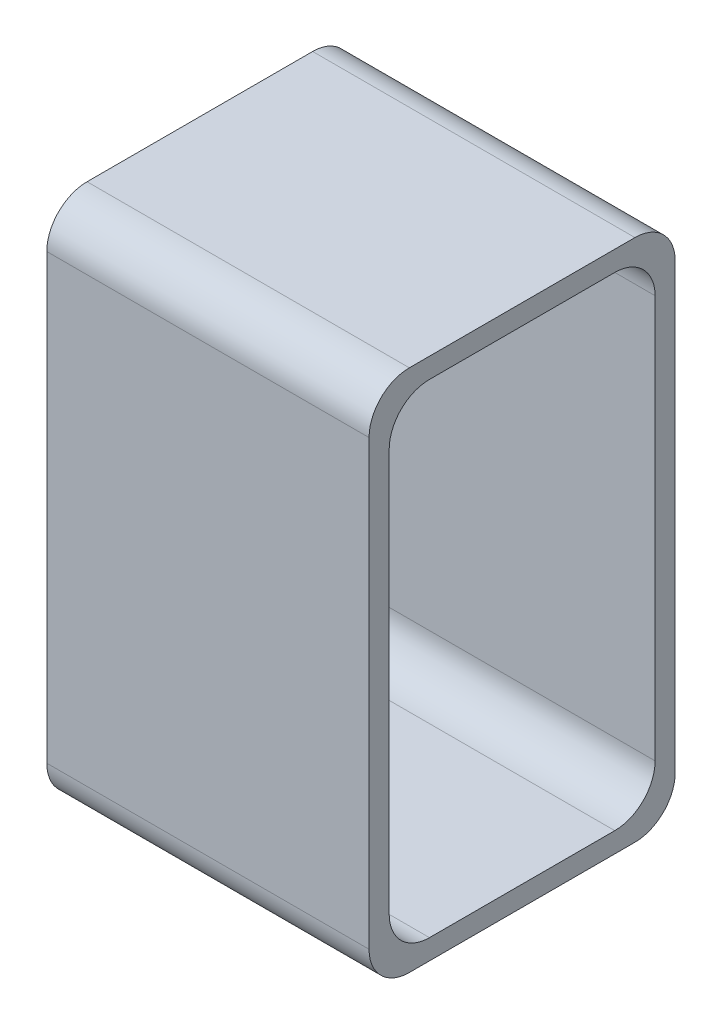
ISO-10303-21;
HEADER;
FILE_DESCRIPTION(('STEP AP214'),'2;1');
FILE_NAME('part.step','',(''),(''),'','','');
FILE_SCHEMA(('AUTOMOTIVE_DESIGN { 1 0 10303 214 1 1 1 1 }'));
ENDSEC;
DATA;
#1=APPLICATION_CONTEXT('core data for automotive mechanical design processes');
#2=APPLICATION_PROTOCOL_DEFINITION('international standard','automotive_design',2000,#1);
#3=PRODUCT_CONTEXT('',#1,'mechanical');
#4=PRODUCT('Part','Part','',(#3));
#5=PRODUCT_RELATED_PRODUCT_CATEGORY('part','',(#4));
#6=PRODUCT_DEFINITION_FORMATION('','',#4);
#7=PRODUCT_DEFINITION_CONTEXT('part definition',#1,'design');
#8=PRODUCT_DEFINITION('design','',#6,#7);
#9=PRODUCT_DEFINITION_SHAPE('','',#8);
#10=(LENGTH_UNIT() NAMED_UNIT(*) SI_UNIT(.MILLI.,.METRE.));
#11=(NAMED_UNIT(*) PLANE_ANGLE_UNIT() SI_UNIT($,.RADIAN.));
#12=(NAMED_UNIT(*) SI_UNIT($,.STERADIAN.) SOLID_ANGLE_UNIT());
#13=UNCERTAINTY_MEASURE_WITH_UNIT(LENGTH_MEASURE(1.E-05),#10,'distance_accuracy_value','');
#14=(GEOMETRIC_REPRESENTATION_CONTEXT(3) GLOBAL_UNCERTAINTY_ASSIGNED_CONTEXT((#13)) GLOBAL_UNIT_ASSIGNED_CONTEXT((#10,
#11,#12)) REPRESENTATION_CONTEXT('',''));
#15=CARTESIAN_POINT('',(0.,0.,0.));
#16=DIRECTION('',(0.,0.,1.));
#17=DIRECTION('',(1.,0.,0.));
#18=AXIS2_PLACEMENT_3D('',#15,#16,#17);
#19=CARTESIAN_POINT('',(0.,0.65,0.));
#20=DIRECTION('',(1.,0.,0.));
#21=DIRECTION('',(0.,0.,-1.));
#22=AXIS2_PLACEMENT_3D('',#19,#20,#21);
#23=PLANE('',#22);
#24=DIRECTION('',(0.,1.,0.));
#25=VECTOR('',#24,1.);
#26=CARTESIAN_POINT('',(0.,0.625,0.0250000000000003));
#27=LINE('',#26,#25);
#28=CARTESIAN_POINT('',(0.,0.075,0.0250000000000002));
#29=VERTEX_POINT('',#28);
#30=CARTESIAN_POINT('',(0.,0.575,0.0250000000000003));
#31=VERTEX_POINT('',#30);
#32=EDGE_CURVE('E297',#29,#31,#27,.T.);
#33=ORIENTED_EDGE('',*,*,#32,.T.);
#34=CARTESIAN_POINT('',(0.,0.575,0.0750000000000002));
#35=DIRECTION('',(1.,0.,0.));
#36=DIRECTION('',(0.,0.,-1.));
#37=AXIS2_PLACEMENT_3D('',#34,#35,#36);
#38=CIRCLE('',#37,0.05);
#39=CARTESIAN_POINT('',(0.,0.625,0.0750000000000002));
#40=VERTEX_POINT('',#39);
#41=EDGE_CURVE('E265',#31,#40,#38,.T.);
#42=ORIENTED_EDGE('',*,*,#41,.T.);
#43=DIRECTION('',(0.,0.,1.));
#44=VECTOR('',#43,1.);
#45=CARTESIAN_POINT('',(0.,0.625,0.355));
#46=LINE('',#45,#44);
#47=CARTESIAN_POINT('',(0.,0.625,0.305));
#48=VERTEX_POINT('',#47);
#49=EDGE_CURVE('E164',#40,#48,#46,.T.);
#50=ORIENTED_EDGE('',*,*,#49,.T.);
#51=CARTESIAN_POINT('',(0.,0.575,0.305));
#52=DIRECTION('',(1.,0.,0.));
#53=DIRECTION('',(0.,0.,-1.));
#54=AXIS2_PLACEMENT_3D('',#51,#52,#53);
#55=CIRCLE('',#54,0.05);
#56=CARTESIAN_POINT('',(0.,0.575,0.355));
#57=VERTEX_POINT('',#56);
#58=EDGE_CURVE('E158',#48,#57,#55,.T.);
#59=ORIENTED_EDGE('',*,*,#58,.T.);
#60=DIRECTION('',(0.,-1.,0.));
#61=VECTOR('',#60,1.);
#62=CARTESIAN_POINT('',(0.,0.625,0.355));
#63=LINE('',#62,#61);
#64=CARTESIAN_POINT('',(0.,0.075,0.355));
#65=VERTEX_POINT('',#64);
#66=EDGE_CURVE('E161',#57,#65,#63,.T.);
#67=ORIENTED_EDGE('',*,*,#66,.T.);
#68=CARTESIAN_POINT('',(0.,0.075,0.305));
#69=DIRECTION('',(1.,0.,0.));
#70=DIRECTION('',(0.,0.,-1.));
#71=AXIS2_PLACEMENT_3D('',#68,#69,#70);
#72=CIRCLE('',#71,0.05);
#73=CARTESIAN_POINT('',(0.,0.025,0.305));
#74=VERTEX_POINT('',#73);
#75=EDGE_CURVE('E271',#65,#74,#72,.T.);
#76=ORIENTED_EDGE('',*,*,#75,.T.);
#77=DIRECTION('',(0.,0.,-1.));
#78=VECTOR('',#77,1.);
#79=CARTESIAN_POINT('',(0.,0.025,0.355));
#80=LINE('',#79,#78);
#81=CARTESIAN_POINT('',(0.,0.025,0.0750000000000002));
#82=VERTEX_POINT('',#81);
#83=EDGE_CURVE('E181',#74,#82,#80,.T.);
#84=ORIENTED_EDGE('',*,*,#83,.T.);
#85=CARTESIAN_POINT('',(0.,0.075,0.0750000000000002));
#86=DIRECTION('',(1.,0.,0.));
#87=DIRECTION('',(0.,0.,-1.));
#88=AXIS2_PLACEMENT_3D('',#85,#86,#87);
#89=CIRCLE('',#88,0.05);
#90=EDGE_CURVE('E11',#82,#29,#89,.T.);
#91=ORIENTED_EDGE('',*,*,#90,.T.);
#92=EDGE_LOOP('',(#33,#42,#50,#59,#67,#76,#84,#91));
#93=FACE_BOUND('',#92,.T.);
#94=DIRECTION('',(0.,-1.,0.));
#95=VECTOR('',#94,1.);
#96=CARTESIAN_POINT('',(0.,0.65,0.38));
#97=LINE('',#96,#95);
#98=CARTESIAN_POINT('',(0.,0.6,0.38));
#99=VERTEX_POINT('',#98);
#100=CARTESIAN_POINT('',(0.,0.05,0.38));
#101=VERTEX_POINT('',#100);
#102=EDGE_CURVE('E292',#99,#101,#97,.T.);
#103=ORIENTED_EDGE('',*,*,#102,.F.);
#104=CARTESIAN_POINT('',(0.,0.6,0.33));
#105=DIRECTION('',(1.,0.,0.));
#106=DIRECTION('',(0.,0.,-1.));
#107=AXIS2_PLACEMENT_3D('',#104,#105,#106);
#108=CIRCLE('',#107,0.05);
#109=CARTESIAN_POINT('',(0.,0.65,0.33));
#110=VERTEX_POINT('',#109);
#111=EDGE_CURVE('E246',#99,#110,#108,.F.);
#112=ORIENTED_EDGE('',*,*,#111,.T.);
#113=DIRECTION('',(0.,0.,1.));
#114=VECTOR('',#113,1.);
#115=CARTESIAN_POINT('',(0.,0.65,0.));
#116=LINE('',#115,#114);
#117=CARTESIAN_POINT('',(0.,0.65,0.05));
#118=VERTEX_POINT('',#117);
#119=EDGE_CURVE('E310',#118,#110,#116,.T.);
#120=ORIENTED_EDGE('',*,*,#119,.F.);
#121=CARTESIAN_POINT('',(0.,0.6,0.05));
#122=DIRECTION('',(1.,0.,0.));
#123=DIRECTION('',(0.,0.,-1.));
#124=AXIS2_PLACEMENT_3D('',#121,#122,#123);
#125=CIRCLE('',#124,0.05);
#126=CARTESIAN_POINT('',(0.,0.6,0.));
#127=VERTEX_POINT('',#126);
#128=EDGE_CURVE('E66',#118,#127,#125,.F.);
#129=ORIENTED_EDGE('',*,*,#128,.T.);
#130=DIRECTION('',(0.,-1.,0.));
#131=VECTOR('',#130,1.);
#132=CARTESIAN_POINT('',(0.,0.65,0.));
#133=LINE('',#132,#131);
#134=CARTESIAN_POINT('',(0.,0.05,0.));
#135=VERTEX_POINT('',#134);
#136=EDGE_CURVE('E319',#127,#135,#133,.T.);
#137=ORIENTED_EDGE('',*,*,#136,.T.);
#138=CARTESIAN_POINT('',(0.,0.05,0.05));
#139=DIRECTION('',(1.,0.,0.));
#140=DIRECTION('',(0.,0.,-1.));
#141=AXIS2_PLACEMENT_3D('',#138,#139,#140);
#142=CIRCLE('',#141,0.05);
#143=CARTESIAN_POINT('',(0.,0.,0.05));
#144=VERTEX_POINT('',#143);
#145=EDGE_CURVE('E58',#135,#144,#142,.F.);
#146=ORIENTED_EDGE('',*,*,#145,.T.);
#147=DIRECTION('',(0.,0.,1.));
#148=VECTOR('',#147,1.);
#149=CARTESIAN_POINT('',(0.,0.,0.));
#150=LINE('',#149,#148);
#151=CARTESIAN_POINT('',(0.,0.,0.33));
#152=VERTEX_POINT('',#151);
#153=EDGE_CURVE('E306',#144,#152,#150,.T.);
#154=ORIENTED_EDGE('',*,*,#153,.T.);
#155=CARTESIAN_POINT('',(0.,0.05,0.33));
#156=DIRECTION('',(1.,0.,0.));
#157=DIRECTION('',(0.,0.,-1.));
#158=AXIS2_PLACEMENT_3D('',#155,#156,#157);
#159=CIRCLE('',#158,0.05);
#160=EDGE_CURVE('E243',#152,#101,#159,.F.);
#161=ORIENTED_EDGE('',*,*,#160,.T.);
#162=EDGE_LOOP('',(#103,#112,#120,#129,#137,#146,#154,#161));
#163=FACE_BOUND('',#162,.T.);
#164=ADVANCED_FACE('F42',(#93,#163),#23,.F.);
#165=CARTESIAN_POINT('',(0.,0.65,0.38));
#166=DIRECTION('',(0.,0.,-1.));
#167=DIRECTION('',(-1.,0.,0.));
#168=AXIS2_PLACEMENT_3D('',#165,#166,#167);
#169=PLANE('',#168);
#170=DIRECTION('',(0.,-1.,0.));
#171=VECTOR('',#170,1.);
#172=CARTESIAN_POINT('',(0.4,0.65,0.38));
#173=LINE('',#172,#171);
#174=CARTESIAN_POINT('',(0.4,0.6,0.38));
#175=VERTEX_POINT('',#174);
#176=CARTESIAN_POINT('',(0.4,0.05,0.38));
#177=VERTEX_POINT('',#176);
#178=EDGE_CURVE('E332',#175,#177,#173,.T.);
#179=ORIENTED_EDGE('',*,*,#178,.F.);
#180=DIRECTION('',(1.,0.,0.));
#181=VECTOR('',#180,1.);
#182=CARTESIAN_POINT('',(0.,0.6,0.38));
#183=LINE('',#182,#181);
#184=EDGE_CURVE('E236',#175,#99,#183,.F.);
#185=ORIENTED_EDGE('',*,*,#184,.T.);
#186=ORIENTED_EDGE('',*,*,#102,.T.);
#187=DIRECTION('',(1.,0.,0.));
#188=VECTOR('',#187,1.);
#189=CARTESIAN_POINT('',(0.,0.05,0.38));
#190=LINE('',#189,#188);
#191=EDGE_CURVE('E232',#101,#177,#190,.T.);
#192=ORIENTED_EDGE('',*,*,#191,.T.);
#193=EDGE_LOOP('',(#179,#185,#186,#192));
#194=FACE_BOUND('',#193,.T.);
#195=ADVANCED_FACE('F360',(#194),#169,.F.);
#196=CARTESIAN_POINT('',(0.4,0.65,0.));
#197=DIRECTION('',(-1.,0.,0.));
#198=DIRECTION('',(0.,0.,1.));
#199=AXIS2_PLACEMENT_3D('',#196,#197,#198);
#200=PLANE('',#199);
#201=DIRECTION('',(0.,-1.,0.));
#202=VECTOR('',#201,1.);
#203=CARTESIAN_POINT('',(0.4,0.65,0.0250000000000001));
#204=LINE('',#203,#202);
#205=CARTESIAN_POINT('',(0.4,0.575,0.0250000000000001));
#206=VERTEX_POINT('',#205);
#207=CARTESIAN_POINT('',(0.4,0.075,0.0250000000000001));
#208=VERTEX_POINT('',#207);
#209=EDGE_CURVE('E282',#206,#208,#204,.T.);
#210=ORIENTED_EDGE('',*,*,#209,.T.);
#211=CARTESIAN_POINT('',(0.4,0.075,0.0750000000000001));
#212=DIRECTION('',(-1.,0.,0.));
#213=DIRECTION('',(0.,0.,1.));
#214=AXIS2_PLACEMENT_3D('',#211,#212,#213);
#215=CIRCLE('',#214,0.05);
#216=CARTESIAN_POINT('',(0.4,0.0249999999999999,0.0750000000000001));
#217=VERTEX_POINT('',#216);
#218=EDGE_CURVE('E51',#208,#217,#215,.T.);
#219=ORIENTED_EDGE('',*,*,#218,.T.);
#220=DIRECTION('',(0.,0.,1.));
#221=VECTOR('',#220,1.);
#222=CARTESIAN_POINT('',(0.4,0.025,0.));
#223=LINE('',#222,#221);
#224=CARTESIAN_POINT('',(0.4,0.0249999999999999,0.305));
#225=VERTEX_POINT('',#224);
#226=EDGE_CURVE('E280',#217,#225,#223,.T.);
#227=ORIENTED_EDGE('',*,*,#226,.T.);
#228=CARTESIAN_POINT('',(0.4,0.075,0.305));
#229=DIRECTION('',(-1.,0.,0.));
#230=DIRECTION('',(0.,0.,1.));
#231=AXIS2_PLACEMENT_3D('',#228,#229,#230);
#232=CIRCLE('',#231,0.05);
#233=CARTESIAN_POINT('',(0.4,0.075,0.355));
#234=VERTEX_POINT('',#233);
#235=EDGE_CURVE('E268',#225,#234,#232,.T.);
#236=ORIENTED_EDGE('',*,*,#235,.T.);
#237=DIRECTION('',(0.,1.,0.));
#238=VECTOR('',#237,1.);
#239=CARTESIAN_POINT('',(0.4,0.65,0.355));
#240=LINE('',#239,#238);
#241=CARTESIAN_POINT('',(0.4,0.575,0.355));
#242=VERTEX_POINT('',#241);
#243=EDGE_CURVE('E192',#234,#242,#240,.T.);
#244=ORIENTED_EDGE('',*,*,#243,.T.);
#245=CARTESIAN_POINT('',(0.4,0.575,0.305));
#246=DIRECTION('',(-1.,0.,0.));
#247=DIRECTION('',(0.,0.,1.));
#248=AXIS2_PLACEMENT_3D('',#245,#246,#247);
#249=CIRCLE('',#248,0.05);
#250=CARTESIAN_POINT('',(0.4,0.625,0.305));
#251=VERTEX_POINT('',#250);
#252=EDGE_CURVE('E170',#242,#251,#249,.T.);
#253=ORIENTED_EDGE('',*,*,#252,.T.);
#254=DIRECTION('',(0.,0.,-1.));
#255=VECTOR('',#254,1.);
#256=CARTESIAN_POINT('',(0.4,0.625,0.));
#257=LINE('',#256,#255);
#258=CARTESIAN_POINT('',(0.4,0.625,0.0750000000000001));
#259=VERTEX_POINT('',#258);
#260=EDGE_CURVE('E341',#251,#259,#257,.T.);
#261=ORIENTED_EDGE('',*,*,#260,.T.);
#262=CARTESIAN_POINT('',(0.4,0.575,0.0750000000000001));
#263=DIRECTION('',(-1.,0.,0.));
#264=DIRECTION('',(0.,0.,1.));
#265=AXIS2_PLACEMENT_3D('',#262,#263,#264);
#266=CIRCLE('',#265,0.05);
#267=EDGE_CURVE('E169',#259,#206,#266,.T.);
#268=ORIENTED_EDGE('',*,*,#267,.T.);
#269=EDGE_LOOP('',(#210,#219,#227,#236,#244,#253,#261,#268));
#270=FACE_BOUND('',#269,.T.);
#271=DIRECTION('',(0.,0.,-1.));
#272=VECTOR('',#271,1.);
#273=CARTESIAN_POINT('',(0.4,0.65,0.));
#274=LINE('',#273,#272);
#275=CARTESIAN_POINT('',(0.4,0.65,0.33));
#276=VERTEX_POINT('',#275);
#277=CARTESIAN_POINT('',(0.4,0.65,0.05));
#278=VERTEX_POINT('',#277);
#279=EDGE_CURVE('E314',#276,#278,#274,.T.);
#280=ORIENTED_EDGE('',*,*,#279,.F.);
#281=CARTESIAN_POINT('',(0.4,0.6,0.33));
#282=DIRECTION('',(-1.,0.,0.));
#283=DIRECTION('',(0.,0.,1.));
#284=AXIS2_PLACEMENT_3D('',#281,#282,#283);
#285=CIRCLE('',#284,0.05);
#286=EDGE_CURVE('E229',#276,#175,#285,.F.);
#287=ORIENTED_EDGE('',*,*,#286,.T.);
#288=ORIENTED_EDGE('',*,*,#178,.T.);
#289=CARTESIAN_POINT('',(0.4,0.05,0.33));
#290=DIRECTION('',(-1.,0.,0.));
#291=DIRECTION('',(0.,0.,1.));
#292=AXIS2_PLACEMENT_3D('',#289,#290,#291);
#293=CIRCLE('',#292,0.05);
#294=CARTESIAN_POINT('',(0.4,0.,0.33));
#295=VERTEX_POINT('',#294);
#296=EDGE_CURVE('E226',#177,#295,#293,.F.);
#297=ORIENTED_EDGE('',*,*,#296,.T.);
#298=DIRECTION('',(0.,0.,-1.));
#299=VECTOR('',#298,1.);
#300=CARTESIAN_POINT('',(0.4,0.,0.));
#301=LINE('',#300,#299);
#302=CARTESIAN_POINT('',(0.4,0.,0.05));
#303=VERTEX_POINT('',#302);
#304=EDGE_CURVE('E315',#295,#303,#301,.T.);
#305=ORIENTED_EDGE('',*,*,#304,.T.);
#306=CARTESIAN_POINT('',(0.4,0.05,0.05));
#307=DIRECTION('',(-1.,0.,0.));
#308=DIRECTION('',(0.,0.,1.));
#309=AXIS2_PLACEMENT_3D('',#306,#307,#308);
#310=CIRCLE('',#309,0.05);
#311=CARTESIAN_POINT('',(0.4,0.05,0.));
#312=VERTEX_POINT('',#311);
#313=EDGE_CURVE('E223',#303,#312,#310,.F.);
#314=ORIENTED_EDGE('',*,*,#313,.T.);
#315=DIRECTION('',(0.,-1.,0.));
#316=VECTOR('',#315,1.);
#317=CARTESIAN_POINT('',(0.4,0.65,0.));
#318=LINE('',#317,#316);
#319=CARTESIAN_POINT('',(0.4,0.6,0.));
#320=VERTEX_POINT('',#319);
#321=EDGE_CURVE('E328',#320,#312,#318,.T.);
#322=ORIENTED_EDGE('',*,*,#321,.F.);
#323=CARTESIAN_POINT('',(0.4,0.6,0.05));
#324=DIRECTION('',(-1.,0.,0.));
#325=DIRECTION('',(0.,0.,1.));
#326=AXIS2_PLACEMENT_3D('',#323,#324,#325);
#327=CIRCLE('',#326,0.05);
#328=EDGE_CURVE('E220',#320,#278,#327,.F.);
#329=ORIENTED_EDGE('',*,*,#328,.T.);
#330=EDGE_LOOP('',(#280,#287,#288,#297,#305,#314,#322,#329));
#331=FACE_BOUND('',#330,.T.);
#332=ADVANCED_FACE('F278',(#270,#331),#200,.F.);
#333=CARTESIAN_POINT('',(0.,0.65,0.));
#334=DIRECTION('',(0.,0.,1.));
#335=DIRECTION('',(1.,0.,0.));
#336=AXIS2_PLACEMENT_3D('',#333,#334,#335);
#337=PLANE('',#336);
#338=ORIENTED_EDGE('',*,*,#321,.T.);
#339=DIRECTION('',(-1.,0.,0.));
#340=VECTOR('',#339,1.);
#341=CARTESIAN_POINT('',(0.,0.05,0.));
#342=LINE('',#341,#340);
#343=EDGE_CURVE('E258',#312,#135,#342,.T.);
#344=ORIENTED_EDGE('',*,*,#343,.T.);
#345=ORIENTED_EDGE('',*,*,#136,.F.);
#346=DIRECTION('',(-1.,0.,0.));
#347=VECTOR('',#346,1.);
#348=CARTESIAN_POINT('',(0.4,0.6,0.));
#349=LINE('',#348,#347);
#350=EDGE_CURVE('E255',#127,#320,#349,.F.);
#351=ORIENTED_EDGE('',*,*,#350,.T.);
#352=EDGE_LOOP('',(#338,#344,#345,#351));
#353=FACE_BOUND('',#352,.T.);
#354=ADVANCED_FACE('F387',(#353),#337,.F.);
#355=CARTESIAN_POINT('',(0.,0.65,0.));
#356=DIRECTION('',(0.,1.,0.));
#357=DIRECTION('',(0.,0.,1.));
#358=AXIS2_PLACEMENT_3D('',#355,#356,#357);
#359=PLANE('',#358);
#360=ORIENTED_EDGE('',*,*,#119,.T.);
#361=DIRECTION('',(1.,0.,0.));
#362=VECTOR('',#361,1.);
#363=CARTESIAN_POINT('',(0.4,0.65,0.33));
#364=LINE('',#363,#362);
#365=EDGE_CURVE('E216',#110,#276,#364,.T.);
#366=ORIENTED_EDGE('',*,*,#365,.T.);
#367=ORIENTED_EDGE('',*,*,#279,.T.);
#368=DIRECTION('',(-1.,0.,0.));
#369=VECTOR('',#368,1.);
#370=CARTESIAN_POINT('',(0.,0.65,0.05));
#371=LINE('',#370,#369);
#372=EDGE_CURVE('E212',#278,#118,#371,.T.);
#373=ORIENTED_EDGE('',*,*,#372,.T.);
#374=EDGE_LOOP('',(#360,#366,#367,#373));
#375=FACE_BOUND('',#374,.T.);
#376=ADVANCED_FACE('F384',(#375),#359,.T.);
#377=CARTESIAN_POINT('',(0.,0.,0.));
#378=DIRECTION('',(0.,1.,0.));
#379=DIRECTION('',(0.,0.,1.));
#380=AXIS2_PLACEMENT_3D('',#377,#378,#379);
#381=PLANE('',#380);
#382=ORIENTED_EDGE('',*,*,#304,.F.);
#383=DIRECTION('',(1.,0.,0.));
#384=VECTOR('',#383,1.);
#385=CARTESIAN_POINT('',(0.,0.,0.33));
#386=LINE('',#385,#384);
#387=EDGE_CURVE('E252',#295,#152,#386,.F.);
#388=ORIENTED_EDGE('',*,*,#387,.T.);
#389=ORIENTED_EDGE('',*,*,#153,.F.);
#390=DIRECTION('',(-1.,0.,0.));
#391=VECTOR('',#390,1.);
#392=CARTESIAN_POINT('',(0.,0.,0.05));
#393=LINE('',#392,#391);
#394=EDGE_CURVE('E249',#144,#303,#393,.F.);
#395=ORIENTED_EDGE('',*,*,#394,.T.);
#396=EDGE_LOOP('',(#382,#388,#389,#395));
#397=FACE_BOUND('',#396,.T.);
#398=ADVANCED_FACE('F383',(#397),#381,.F.);
#399=CARTESIAN_POINT('',(0.,0.625,0.355));
#400=DIRECTION('',(0.,0.,1.));
#401=DIRECTION('',(1.,0.,0.));
#402=AXIS2_PLACEMENT_3D('',#399,#400,#401);
#403=PLANE('',#402);
#404=ORIENTED_EDGE('',*,*,#66,.F.);
#405=DIRECTION('',(1.,0.,0.));
#406=VECTOR('',#405,1.);
#407=CARTESIAN_POINT('',(0.4,0.575,0.355));
#408=LINE('',#407,#406);
#409=EDGE_CURVE('E176',#57,#242,#408,.T.);
#410=ORIENTED_EDGE('',*,*,#409,.T.);
#411=ORIENTED_EDGE('',*,*,#243,.F.);
#412=DIRECTION('',(1.,0.,0.));
#413=VECTOR('',#412,1.);
#414=CARTESIAN_POINT('',(0.,0.075,0.355));
#415=LINE('',#414,#413);
#416=EDGE_CURVE('E179',#234,#65,#415,.F.);
#417=ORIENTED_EDGE('',*,*,#416,.T.);
#418=EDGE_LOOP('',(#404,#410,#411,#417));
#419=FACE_BOUND('',#418,.T.);
#420=ADVANCED_FACE('F174',(#419),#403,.F.);
#421=CARTESIAN_POINT('',(0.,0.625,0.355));
#422=DIRECTION('',(0.,1.,0.));
#423=DIRECTION('',(0.,0.,1.));
#424=AXIS2_PLACEMENT_3D('',#421,#422,#423);
#425=PLANE('',#424);
#426=ORIENTED_EDGE('',*,*,#260,.F.);
#427=DIRECTION('',(1.,0.,0.));
#428=VECTOR('',#427,1.);
#429=CARTESIAN_POINT('',(0.,0.625,0.305));
#430=LINE('',#429,#428);
#431=EDGE_CURVE('E190',#251,#48,#430,.F.);
#432=ORIENTED_EDGE('',*,*,#431,.T.);
#433=ORIENTED_EDGE('',*,*,#49,.F.);
#434=DIRECTION('',(1.,0.,0.));
#435=VECTOR('',#434,1.);
#436=CARTESIAN_POINT('',(0.4,0.625,0.0750000000000001));
#437=LINE('',#436,#435);
#438=EDGE_CURVE('E185',#40,#259,#437,.T.);
#439=ORIENTED_EDGE('',*,*,#438,.T.);
#440=EDGE_LOOP('',(#426,#432,#433,#439));
#441=FACE_BOUND('',#440,.T.);
#442=ADVANCED_FACE('F377',(#441),#425,.F.);
#443=CARTESIAN_POINT('',(0.,0.625,0.0250000000000003));
#444=DIRECTION('',(0.,0.,-1.));
#445=DIRECTION('',(-1.,0.,0.));
#446=AXIS2_PLACEMENT_3D('',#443,#444,#445);
#447=PLANE('',#446);
#448=ORIENTED_EDGE('',*,*,#209,.F.);
#449=DIRECTION('',(1.,0.,0.));
#450=VECTOR('',#449,1.);
#451=CARTESIAN_POINT('',(0.,0.575,0.0250000000000003));
#452=LINE('',#451,#450);
#453=EDGE_CURVE('E202',#206,#31,#452,.F.);
#454=ORIENTED_EDGE('',*,*,#453,.T.);
#455=ORIENTED_EDGE('',*,*,#32,.F.);
#456=DIRECTION('',(1.,0.,0.));
#457=VECTOR('',#456,1.);
#458=CARTESIAN_POINT('',(0.4,0.075,0.0250000000000001));
#459=LINE('',#458,#457);
#460=EDGE_CURVE('E198',#29,#208,#459,.T.);
#461=ORIENTED_EDGE('',*,*,#460,.T.);
#462=EDGE_LOOP('',(#448,#454,#455,#461));
#463=FACE_BOUND('',#462,.T.);
#464=ADVANCED_FACE('F300',(#463),#447,.F.);
#465=CARTESIAN_POINT('',(0.,0.025,0.355));
#466=DIRECTION('',(0.,-1.,0.));
#467=DIRECTION('',(0.,0.,-1.));
#468=AXIS2_PLACEMENT_3D('',#465,#466,#467);
#469=PLANE('',#468);
#470=ORIENTED_EDGE('',*,*,#83,.F.);
#471=DIRECTION('',(1.,0.,0.));
#472=VECTOR('',#471,1.);
#473=CARTESIAN_POINT('',(0.4,0.025,0.305));
#474=LINE('',#473,#472);
#475=EDGE_CURVE('E208',#74,#225,#474,.T.);
#476=ORIENTED_EDGE('',*,*,#475,.T.);
#477=ORIENTED_EDGE('',*,*,#226,.F.);
#478=DIRECTION('',(1.,0.,0.));
#479=VECTOR('',#478,1.);
#480=CARTESIAN_POINT('',(0.,0.025,0.0750000000000002));
#481=LINE('',#480,#479);
#482=EDGE_CURVE('E205',#217,#82,#481,.F.);
#483=ORIENTED_EDGE('',*,*,#482,.T.);
#484=EDGE_LOOP('',(#470,#476,#477,#483));
#485=FACE_BOUND('',#484,.T.);
#486=ADVANCED_FACE('F288',(#485),#469,.F.);
#487=CARTESIAN_POINT('',(0.,0.575,0.305));
#488=DIRECTION('',(-1.,0.,0.));
#489=DIRECTION('',(0.,0.,1.));
#490=AXIS2_PLACEMENT_3D('',#487,#488,#489);
#491=CYLINDRICAL_SURFACE('',#490,0.05);
#492=ORIENTED_EDGE('',*,*,#58,.F.);
#493=ORIENTED_EDGE('',*,*,#431,.F.);
#494=ORIENTED_EDGE('',*,*,#252,.F.);
#495=ORIENTED_EDGE('',*,*,#409,.F.);
#496=EDGE_LOOP('',(#492,#493,#494,#495));
#497=FACE_BOUND('',#496,.T.);
#498=ADVANCED_FACE('F183',(#497),#491,.F.);
#499=CARTESIAN_POINT('',(0.,0.575,0.0750000000000002));
#500=DIRECTION('',(-1.,0.,0.));
#501=DIRECTION('',(0.,0.,1.));
#502=AXIS2_PLACEMENT_3D('',#499,#500,#501);
#503=CYLINDRICAL_SURFACE('',#502,0.05);
#504=ORIENTED_EDGE('',*,*,#41,.F.);
#505=ORIENTED_EDGE('',*,*,#453,.F.);
#506=ORIENTED_EDGE('',*,*,#267,.F.);
#507=ORIENTED_EDGE('',*,*,#438,.F.);
#508=EDGE_LOOP('',(#504,#505,#506,#507));
#509=FACE_BOUND('',#508,.T.);
#510=ADVANCED_FACE('F349',(#509),#503,.F.);
#511=CARTESIAN_POINT('',(0.,0.075,0.305));
#512=DIRECTION('',(-1.,0.,0.));
#513=DIRECTION('',(0.,0.,1.));
#514=AXIS2_PLACEMENT_3D('',#511,#512,#513);
#515=CYLINDRICAL_SURFACE('',#514,0.05);
#516=ORIENTED_EDGE('',*,*,#75,.F.);
#517=ORIENTED_EDGE('',*,*,#416,.F.);
#518=ORIENTED_EDGE('',*,*,#235,.F.);
#519=ORIENTED_EDGE('',*,*,#475,.F.);
#520=EDGE_LOOP('',(#516,#517,#518,#519));
#521=FACE_BOUND('',#520,.T.);
#522=ADVANCED_FACE('F347',(#521),#515,.F.);
#523=CARTESIAN_POINT('',(0.,0.075,0.0750000000000002));
#524=DIRECTION('',(-1.,0.,0.));
#525=DIRECTION('',(0.,0.,1.));
#526=AXIS2_PLACEMENT_3D('',#523,#524,#525);
#527=CYLINDRICAL_SURFACE('',#526,0.05);
#528=ORIENTED_EDGE('',*,*,#90,.F.);
#529=ORIENTED_EDGE('',*,*,#482,.F.);
#530=ORIENTED_EDGE('',*,*,#218,.F.);
#531=ORIENTED_EDGE('',*,*,#460,.F.);
#532=EDGE_LOOP('',(#528,#529,#530,#531));
#533=FACE_BOUND('',#532,.T.);
#534=ADVANCED_FACE('F295',(#533),#527,.F.);
#535=CARTESIAN_POINT('',(0.,0.6,0.33));
#536=DIRECTION('',(-1.,0.,0.));
#537=DIRECTION('',(0.,0.,1.));
#538=AXIS2_PLACEMENT_3D('',#535,#536,#537);
#539=CYLINDRICAL_SURFACE('',#538,0.05);
#540=ORIENTED_EDGE('',*,*,#111,.F.);
#541=ORIENTED_EDGE('',*,*,#184,.F.);
#542=ORIENTED_EDGE('',*,*,#286,.F.);
#543=ORIENTED_EDGE('',*,*,#365,.F.);
#544=EDGE_LOOP('',(#540,#541,#542,#543));
#545=FACE_BOUND('',#544,.T.);
#546=ADVANCED_FACE('F355',(#545),#539,.T.);
#547=CARTESIAN_POINT('',(0.,0.05,0.33));
#548=DIRECTION('',(1.,0.,0.));
#549=DIRECTION('',(0.,0.,-1.));
#550=AXIS2_PLACEMENT_3D('',#547,#548,#549);
#551=CYLINDRICAL_SURFACE('',#550,0.05);
#552=ORIENTED_EDGE('',*,*,#160,.F.);
#553=ORIENTED_EDGE('',*,*,#387,.F.);
#554=ORIENTED_EDGE('',*,*,#296,.F.);
#555=ORIENTED_EDGE('',*,*,#191,.F.);
#556=EDGE_LOOP('',(#552,#553,#554,#555));
#557=FACE_BOUND('',#556,.T.);
#558=ADVANCED_FACE('F464',(#557),#551,.T.);
#559=CARTESIAN_POINT('',(0.,0.05,0.05));
#560=DIRECTION('',(-1.,0.,0.));
#561=DIRECTION('',(0.,0.,1.));
#562=AXIS2_PLACEMENT_3D('',#559,#560,#561);
#563=CYLINDRICAL_SURFACE('',#562,0.05);
#564=ORIENTED_EDGE('',*,*,#313,.F.);
#565=ORIENTED_EDGE('',*,*,#394,.F.);
#566=ORIENTED_EDGE('',*,*,#145,.F.);
#567=ORIENTED_EDGE('',*,*,#343,.F.);
#568=EDGE_LOOP('',(#564,#565,#566,#567));
#569=FACE_BOUND('',#568,.T.);
#570=ADVANCED_FACE('F475',(#569),#563,.T.);
#571=CARTESIAN_POINT('',(0.,0.6,0.05));
#572=DIRECTION('',(1.,0.,0.));
#573=DIRECTION('',(0.,0.,-1.));
#574=AXIS2_PLACEMENT_3D('',#571,#572,#573);
#575=CYLINDRICAL_SURFACE('',#574,0.05);
#576=ORIENTED_EDGE('',*,*,#328,.F.);
#577=ORIENTED_EDGE('',*,*,#350,.F.);
#578=ORIENTED_EDGE('',*,*,#128,.F.);
#579=ORIENTED_EDGE('',*,*,#372,.F.);
#580=EDGE_LOOP('',(#576,#577,#578,#579));
#581=FACE_BOUND('',#580,.T.);
#582=ADVANCED_FACE('F44',(#581),#575,.T.);
#583=CLOSED_SHELL('',(#164,#195,#332,#354,#376,#398,#420,#442,#464,#486,#498,#510,#522,#534,
#546,#558,#570,#582));
#584=MANIFOLD_SOLID_BREP('B2',#583);
#585=ADVANCED_BREP_SHAPE_REPRESENTATION('',(#18,#584),#14);
#586=SHAPE_DEFINITION_REPRESENTATION(#9,#585);
ENDSEC;
END-ISO-10303-21;
